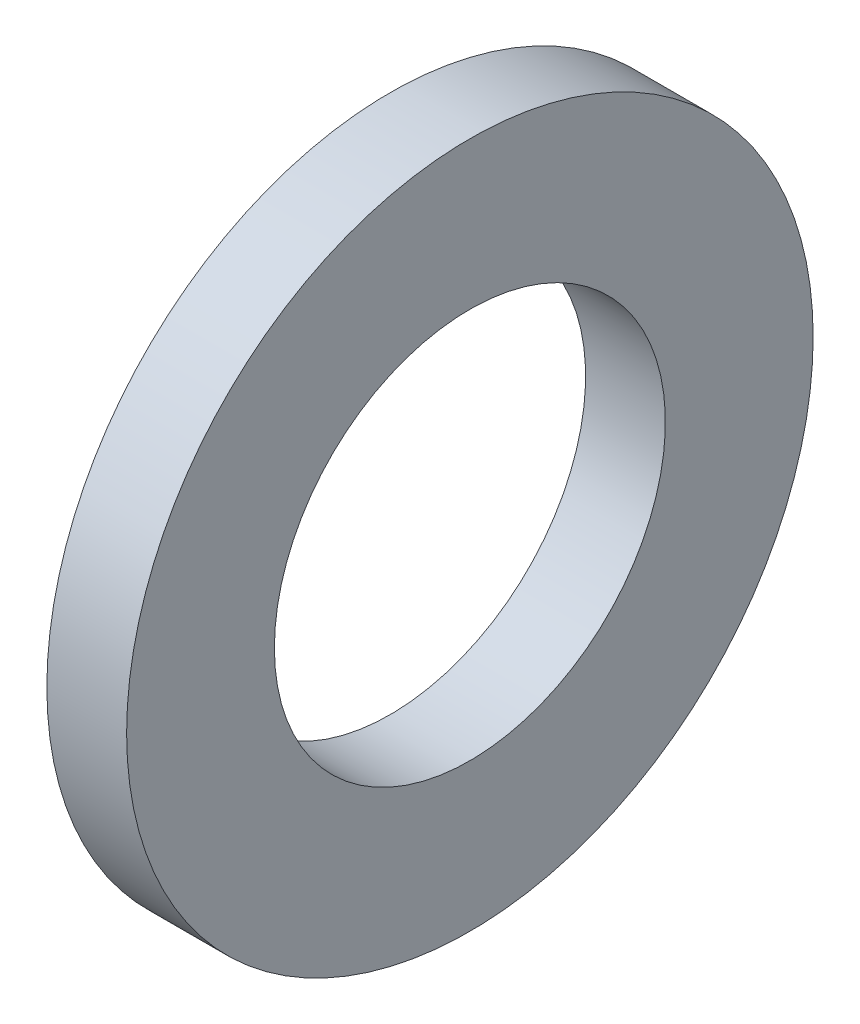
ISO-10303-21;
HEADER;
FILE_DESCRIPTION(('STEP AP214'),'2;1');
FILE_NAME('part.step','',(''),(''),'','','');
FILE_SCHEMA(('AUTOMOTIVE_DESIGN { 1 0 10303 214 1 1 1 1 }'));
ENDSEC;
DATA;
#1=APPLICATION_CONTEXT('core data for automotive mechanical design processes');
#2=APPLICATION_PROTOCOL_DEFINITION('international standard','automotive_design',2000,#1);
#3=PRODUCT_CONTEXT('',#1,'mechanical');
#4=PRODUCT('Part','Part','',(#3));
#5=PRODUCT_RELATED_PRODUCT_CATEGORY('part','',(#4));
#6=PRODUCT_DEFINITION_FORMATION('','',#4);
#7=PRODUCT_DEFINITION_CONTEXT('part definition',#1,'design');
#8=PRODUCT_DEFINITION('design','',#6,#7);
#9=PRODUCT_DEFINITION_SHAPE('','',#8);
#10=(LENGTH_UNIT() NAMED_UNIT(*) SI_UNIT(.MILLI.,.METRE.));
#11=(NAMED_UNIT(*) PLANE_ANGLE_UNIT() SI_UNIT($,.RADIAN.));
#12=(NAMED_UNIT(*) SI_UNIT($,.STERADIAN.) SOLID_ANGLE_UNIT());
#13=UNCERTAINTY_MEASURE_WITH_UNIT(LENGTH_MEASURE(1.E-05),#10,'distance_accuracy_value','');
#14=(GEOMETRIC_REPRESENTATION_CONTEXT(3) GLOBAL_UNCERTAINTY_ASSIGNED_CONTEXT((#13)) GLOBAL_UNIT_ASSIGNED_CONTEXT((#10,
#11,#12)) REPRESENTATION_CONTEXT('',''));
#15=CARTESIAN_POINT('',(0.,0.,0.));
#16=DIRECTION('',(0.,0.,1.));
#17=DIRECTION('',(1.,0.,0.));
#18=AXIS2_PLACEMENT_3D('',#15,#16,#17);
#19=CARTESIAN_POINT('',(0.,0.,0.));
#20=DIRECTION('',(-1.,0.,0.));
#21=DIRECTION('',(0.,0.,1.));
#22=AXIS2_PLACEMENT_3D('',#19,#20,#21);
#23=CYLINDRICAL_SURFACE('',#22,7.9375);
#24=CARTESIAN_POINT('',(5.009399684,0.,0.));
#25=DIRECTION('',(-1.,0.,0.));
#26=DIRECTION('',(0.,0.,1.));
#27=AXIS2_PLACEMENT_3D('',#24,#25,#26);
#28=CIRCLE('',#27,7.9375);
#29=CARTESIAN_POINT('',(5.009399684,0.,7.9375));
#30=VERTEX_POINT('',#29);
#31=EDGE_CURVE('E49',#30,#30,#28,.T.);
#32=ORIENTED_EDGE('',*,*,#31,.F.);
#33=EDGE_LOOP('',(#32));
#34=FACE_BOUND('',#33,.T.);
#35=CARTESIAN_POINT('',(1.77089968399999,0.,0.));
#36=DIRECTION('',(-1.,0.,0.));
#37=DIRECTION('',(0.,0.,1.));
#38=AXIS2_PLACEMENT_3D('',#35,#36,#37);
#39=CIRCLE('',#38,7.9375);
#40=CARTESIAN_POINT('',(1.77089968399999,0.,7.9375));
#41=VERTEX_POINT('',#40);
#42=EDGE_CURVE('E10',#41,#41,#39,.T.);
#43=ORIENTED_EDGE('',*,*,#42,.T.);
#44=EDGE_LOOP('',(#43));
#45=FACE_BOUND('',#44,.T.);
#46=ADVANCED_FACE('F35',(#34,#45),#23,.F.);
#47=CARTESIAN_POINT('',(1.77089968399999,7.9375,0.));
#48=DIRECTION('',(1.,0.,0.));
#49=DIRECTION('',(0.,0.,-1.));
#50=AXIS2_PLACEMENT_3D('',#47,#48,#49);
#51=PLANE('',#50);
#52=ORIENTED_EDGE('',*,*,#42,.F.);
#53=EDGE_LOOP('',(#52));
#54=FACE_BOUND('',#53,.T.);
#55=CARTESIAN_POINT('',(1.77089968399999,0.,0.));
#56=DIRECTION('',(-1.,0.,0.));
#57=DIRECTION('',(0.,0.,1.));
#58=AXIS2_PLACEMENT_3D('',#55,#56,#57);
#59=CIRCLE('',#58,13.93649994);
#60=CARTESIAN_POINT('',(1.77089968399999,0.,13.93649994));
#61=VERTEX_POINT('',#60);
#62=EDGE_CURVE('E41',#61,#61,#59,.T.);
#63=ORIENTED_EDGE('',*,*,#62,.T.);
#64=EDGE_LOOP('',(#63));
#65=FACE_BOUND('',#64,.T.);
#66=ADVANCED_FACE('F58',(#54,#65),#51,.F.);
#67=CARTESIAN_POINT('',(0.,0.,0.));
#68=DIRECTION('',(-1.,0.,0.));
#69=DIRECTION('',(0.,0.,1.));
#70=AXIS2_PLACEMENT_3D('',#67,#68,#69);
#71=CYLINDRICAL_SURFACE('',#70,13.93649994);
#72=ORIENTED_EDGE('',*,*,#62,.F.);
#73=EDGE_LOOP('',(#72));
#74=FACE_BOUND('',#73,.T.);
#75=CARTESIAN_POINT('',(5.009399684,0.,0.));
#76=DIRECTION('',(-1.,0.,0.));
#77=DIRECTION('',(0.,0.,1.));
#78=AXIS2_PLACEMENT_3D('',#75,#76,#77);
#79=CIRCLE('',#78,13.93649994);
#80=CARTESIAN_POINT('',(5.009399684,0.,13.93649994));
#81=VERTEX_POINT('',#80);
#82=EDGE_CURVE('E45',#81,#81,#79,.T.);
#83=ORIENTED_EDGE('',*,*,#82,.T.);
#84=EDGE_LOOP('',(#83));
#85=FACE_BOUND('',#84,.T.);
#86=ADVANCED_FACE('F62',(#74,#85),#71,.T.);
#87=CARTESIAN_POINT('',(5.009399684,7.9375,0.));
#88=DIRECTION('',(-1.,0.,0.));
#89=DIRECTION('',(0.,0.,1.));
#90=AXIS2_PLACEMENT_3D('',#87,#88,#89);
#91=PLANE('',#90);
#92=ORIENTED_EDGE('',*,*,#82,.F.);
#93=EDGE_LOOP('',(#92));
#94=FACE_BOUND('',#93,.T.);
#95=ORIENTED_EDGE('',*,*,#31,.T.);
#96=EDGE_LOOP('',(#95));
#97=FACE_BOUND('',#96,.T.);
#98=ADVANCED_FACE('F55',(#94,#97),#91,.F.);
#99=CLOSED_SHELL('',(#46,#66,#86,#98));
#100=MANIFOLD_SOLID_BREP('B2',#99);
#101=ADVANCED_BREP_SHAPE_REPRESENTATION('',(#18,#100),#14);
#102=SHAPE_DEFINITION_REPRESENTATION(#9,#101);
ENDSEC;
END-ISO-10303-21;
